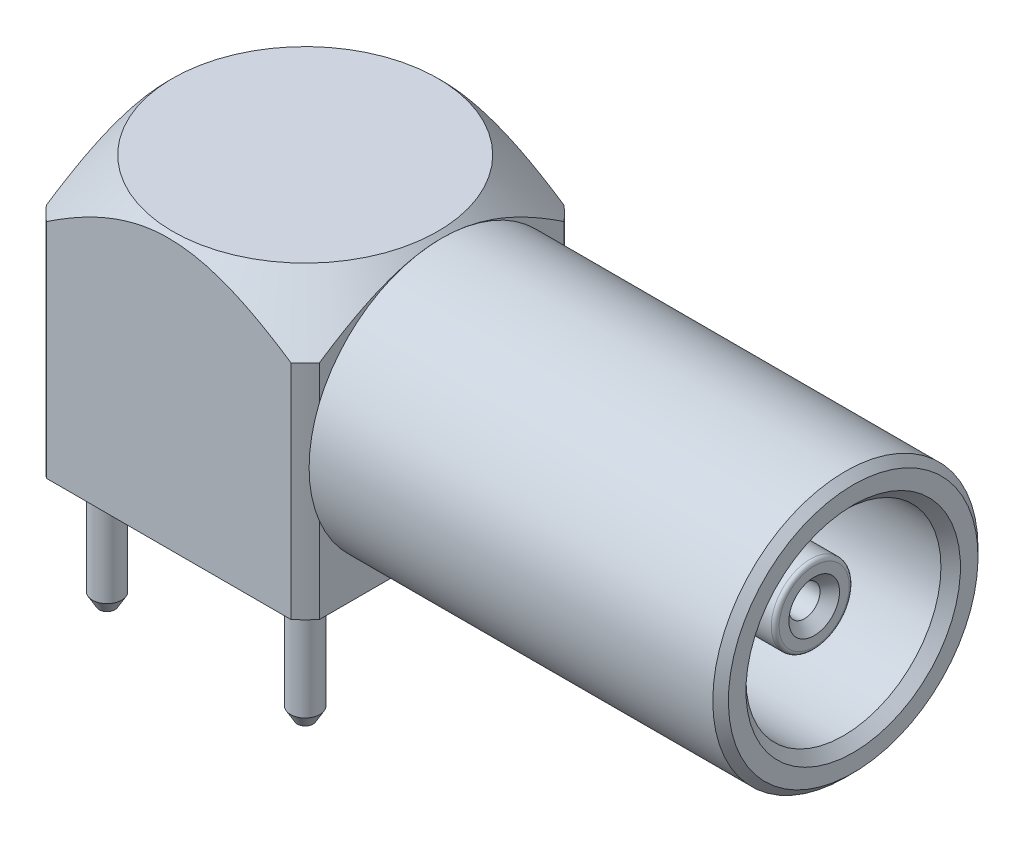
ISO-10303-21;
HEADER;
FILE_DESCRIPTION(('STEP AP214'),'2;1');
FILE_NAME('part.step','',(''),(''),'','','');
FILE_SCHEMA(('AUTOMOTIVE_DESIGN { 1 0 10303 214 1 1 1 1 }'));
ENDSEC;
DATA;
#1=APPLICATION_CONTEXT('core data for automotive mechanical design processes');
#2=APPLICATION_PROTOCOL_DEFINITION('international standard','automotive_design',2000,#1);
#3=PRODUCT_CONTEXT('',#1,'mechanical');
#4=PRODUCT('Part','Part','',(#3));
#5=PRODUCT_RELATED_PRODUCT_CATEGORY('part','',(#4));
#6=PRODUCT_DEFINITION_FORMATION('','',#4);
#7=PRODUCT_DEFINITION_CONTEXT('part definition',#1,'design');
#8=PRODUCT_DEFINITION('design','',#6,#7);
#9=PRODUCT_DEFINITION_SHAPE('','',#8);
#10=(LENGTH_UNIT() NAMED_UNIT(*) SI_UNIT(.MILLI.,.METRE.));
#11=(NAMED_UNIT(*) PLANE_ANGLE_UNIT() SI_UNIT($,.RADIAN.));
#12=(NAMED_UNIT(*) SI_UNIT($,.STERADIAN.) SOLID_ANGLE_UNIT());
#13=UNCERTAINTY_MEASURE_WITH_UNIT(LENGTH_MEASURE(1.E-05),#10,'distance_accuracy_value','');
#14=(GEOMETRIC_REPRESENTATION_CONTEXT(3) GLOBAL_UNCERTAINTY_ASSIGNED_CONTEXT((#13)) GLOBAL_UNIT_ASSIGNED_CONTEXT((#10,
#11,#12)) REPRESENTATION_CONTEXT('',''));
#15=CARTESIAN_POINT('',(0.,0.,0.));
#16=DIRECTION('',(0.,0.,1.));
#17=DIRECTION('',(1.,0.,0.));
#18=AXIS2_PLACEMENT_3D('',#15,#16,#17);
#19=CARTESIAN_POINT('',(-9.,0.,0.));
#20=DIRECTION('',(1.,0.,0.));
#21=DIRECTION('',(0.,1.,0.));
#22=AXIS2_PLACEMENT_3D('',#19,#20,#21);
#23=CYLINDRICAL_SURFACE('',#22,1.);
#24=CARTESIAN_POINT('',(-1.1,0.,0.));
#25=DIRECTION('',(1.,0.,0.));
#26=DIRECTION('',(0.,1.,0.));
#27=AXIS2_PLACEMENT_3D('',#24,#25,#26);
#28=CIRCLE('',#27,1.);
#29=CARTESIAN_POINT('',(-1.1,1.,0.));
#30=VERTEX_POINT('',#29);
#31=EDGE_CURVE('E440',#30,#30,#28,.F.);
#32=ORIENTED_EDGE('',*,*,#31,.T.);
#33=EDGE_LOOP('',(#32));
#34=FACE_BOUND('',#33,.T.);
#35=CARTESIAN_POINT('',(-9.,0.,0.));
#36=DIRECTION('',(1.,0.,0.));
#37=DIRECTION('',(0.,1.,0.));
#38=AXIS2_PLACEMENT_3D('',#35,#36,#37);
#39=CIRCLE('',#38,1.);
#40=CARTESIAN_POINT('',(-9.,0.999999999999999,0.));
#41=VERTEX_POINT('',#40);
#42=EDGE_CURVE('E623',#41,#41,#39,.T.);
#43=ORIENTED_EDGE('',*,*,#42,.T.);
#44=EDGE_LOOP('',(#43));
#45=FACE_BOUND('',#44,.T.);
#46=ADVANCED_FACE('F49',(#34,#45),#23,.T.);
#47=CARTESIAN_POINT('',(-10.55,3.5,-8.75251334901552E-07));
#48=DIRECTION('',(1.,0.,0.));
#49=DIRECTION('',(0.,1.,0.));
#50=AXIS2_PLACEMENT_3D('',#47,#48,#49);
#51=PLANE('',#50);
#52=CARTESIAN_POINT('',(-10.55,2.2,-3.13687830352296));
#53=CARTESIAN_POINT('',(-10.55,3.4,-1.33891197268435));
#54=CARTESIAN_POINT('',(-10.55,3.4,-8.75251335255347E-07));
#55=(BOUNDED_CURVE() B_SPLINE_CURVE(2,(#52,#53,#54),.UNSPECIFIED.,.F.,
.F.) B_SPLINE_CURVE_WITH_KNOTS((3,3),(0.0289629394687463,0.378837270102338),
.UNSPECIFIED.) CURVE() GEOMETRIC_REPRESENTATION_ITEM() RATIONAL_B_SPLINE_CURVE((1.03045700832998,
1.20710678118655,1.20710678118655)) REPRESENTATION_ITEM(''));
#56=CARTESIAN_POINT('',(-10.55,2.2,-3.13687830352296));
#57=VERTEX_POINT('',#56);
#58=CARTESIAN_POINT('',(-10.55,3.4,-8.75251334901552E-07));
#59=VERTEX_POINT('',#58);
#60=EDGE_CURVE('E318',#57,#59,#55,.T.);
#61=ORIENTED_EDGE('',*,*,#60,.T.);
#62=CARTESIAN_POINT('',(-10.55,0.,-8.75251334901552E-07));
#63=DIRECTION('',(-1.,0.,0.));
#64=DIRECTION('',(0.,1.,0.));
#65=AXIS2_PLACEMENT_3D('',#62,#63,#64);
#66=CIRCLE('',#65,3.4);
#67=CARTESIAN_POINT('',(-10.55,1.31148770486039,-3.13687830352296));
#68=VERTEX_POINT('',#67);
#69=EDGE_CURVE('E266',#59,#68,#66,.T.);
#70=ORIENTED_EDGE('',*,*,#69,.T.);
#71=DIRECTION('',(0.,1.,0.));
#72=VECTOR('',#71,1.);
#73=CARTESIAN_POINT('',(-10.55,-3.5,-3.13687830352296));
#74=LINE('',#73,#72);
#75=EDGE_CURVE('E254',#68,#57,#74,.T.);
#76=ORIENTED_EDGE('',*,*,#75,.T.);
#77=EDGE_LOOP('',(#61,#70,#76));
#78=FACE_BOUND('',#77,.T.);
#79=ADVANCED_FACE('F458',(#78),#51,.T.);
#80=CARTESIAN_POINT('',(-14.05,0.,-3.50000087525133));
#81=DIRECTION('',(0.,0.,1.));
#82=DIRECTION('',(1.,0.,0.));
#83=AXIS2_PLACEMENT_3D('',#80,#81,#82);
#84=PLANE('',#83);
#85=CARTESIAN_POINT('',(-17.1868774282716,2.2,-3.50000087525134));
#86=CARTESIAN_POINT('',(-14.0500000000002,4.29361702127646,-3.50000087525133));
#87=CARTESIAN_POINT('',(-10.9131225717291,2.20000000000048,-3.50000087525133));
#88=(BOUNDED_CURVE() B_SPLINE_CURVE(2,(#85,#86,#87),.UNSPECIFIED.,.F.,
.F.) B_SPLINE_CURVE_WITH_KNOTS((3,3),(0.0289629394687464,0.728711600736026),
.UNSPECIFIED.) CURVE() GEOMETRIC_REPRESENTATION_ITEM() RATIONAL_B_SPLINE_CURVE((1.03045700832998,
1.38375655404309,1.03045700833004)) REPRESENTATION_ITEM(''));
#89=CARTESIAN_POINT('',(-17.1868774282716,2.2,-3.50000087525133));
#90=VERTEX_POINT('',#89);
#91=CARTESIAN_POINT('',(-10.9131225717284,2.2,-3.50000087525134));
#92=VERTEX_POINT('',#91);
#93=EDGE_CURVE('E347',#90,#92,#88,.T.);
#94=ORIENTED_EDGE('',*,*,#93,.T.);
#95=DIRECTION('',(0.,-1.,0.));
#96=VECTOR('',#95,1.);
#97=CARTESIAN_POINT('',(-10.9131225717284,-3.5,-3.50000087525133));
#98=LINE('',#97,#96);
#99=CARTESIAN_POINT('',(-10.9131225717284,-3.5,-3.50000087525133));
#100=VERTEX_POINT('',#99);
#101=EDGE_CURVE('E250',#92,#100,#98,.T.);
#102=ORIENTED_EDGE('',*,*,#101,.T.);
#103=DIRECTION('',(1.,0.,0.));
#104=VECTOR('',#103,1.);
#105=CARTESIAN_POINT('',(-10.55,-3.5,-3.50000087525133));
#106=LINE('',#105,#104);
#107=CARTESIAN_POINT('',(-17.1868774282716,-3.5,-3.50000087525133));
#108=VERTEX_POINT('',#107);
#109=EDGE_CURVE('E333',#108,#100,#106,.T.);
#110=ORIENTED_EDGE('',*,*,#109,.F.);
#111=DIRECTION('',(0.,1.,0.));
#112=VECTOR('',#111,1.);
#113=CARTESIAN_POINT('',(-17.1868774282716,-3.5,-3.50000087525133));
#114=LINE('',#113,#112);
#115=EDGE_CURVE('E286',#108,#90,#114,.T.);
#116=ORIENTED_EDGE('',*,*,#115,.T.);
#117=EDGE_LOOP('',(#94,#102,#110,#116));
#118=FACE_BOUND('',#117,.T.);
#119=ADVANCED_FACE('F465',(#118),#84,.F.);
#120=CARTESIAN_POINT('',(-11.51,-6.35,-2.54000087525133));
#121=DIRECTION('',(0.,1.,0.));
#122=DIRECTION('',(-0.48171210335396,0.,0.876329532471834));
#123=AXIS2_PLACEMENT_3D('',#120,#121,#122);
#124=CONICAL_SURFACE('',#123,0.288397459621557,0.523598775598299);
#125=CARTESIAN_POINT('',(-11.51,-6.2,-2.54000087525133));
#126=DIRECTION('',(0.,-1.,0.));
#127=DIRECTION('',(-0.48171210335396,0.,0.876329532471834));
#128=AXIS2_PLACEMENT_3D('',#125,#126,#127);
#129=CIRCLE('',#128,0.375);
#130=CARTESIAN_POINT('',(-11.3293579612423,-6.2,-2.86862444992827));
#131=VERTEX_POINT('',#130);
#132=EDGE_CURVE('E397',#131,#131,#129,.T.);
#133=ORIENTED_EDGE('',*,*,#132,.T.);
#134=EDGE_LOOP('',(#133));
#135=FACE_BOUND('',#134,.T.);
#136=CARTESIAN_POINT('',(-11.51,-6.5,-2.54000087525133));
#137=DIRECTION('',(0.,1.,0.));
#138=DIRECTION('',(-0.48171210335396,0.,0.876329532471834));
#139=AXIS2_PLACEMENT_3D('',#136,#137,#138);
#140=CIRCLE('',#139,0.201794919243113);
#141=CARTESIAN_POINT('',(-11.4127929450053,-6.5,-2.71683972248684));
#142=VERTEX_POINT('',#141);
#143=EDGE_CURVE('E67',#142,#142,#140,.T.);
#144=ORIENTED_EDGE('',*,*,#143,.T.);
#145=EDGE_LOOP('',(#144));
#146=FACE_BOUND('',#145,.T.);
#147=ADVANCED_FACE('F494',(#135,#146),#124,.T.);
#148=CARTESIAN_POINT('',(-11.4196789806211,-6.5,-2.7043126625898));
#149=DIRECTION('',(0.,-1.,0.));
#150=DIRECTION('',(0.,0.,-1.));
#151=AXIS2_PLACEMENT_3D('',#148,#149,#150);
#152=PLANE('',#151);
#153=ORIENTED_EDGE('',*,*,#143,.F.);
#154=EDGE_LOOP('',(#153));
#155=FACE_BOUND('',#154,.T.);
#156=ADVANCED_FACE('F495',(#155),#152,.T.);
#157=CARTESIAN_POINT('',(-11.51,-4.9,-2.54000087525133));
#158=DIRECTION('',(0.,1.,0.));
#159=DIRECTION('',(0.48171210335396,0.,-0.876329532471834));
#160=AXIS2_PLACEMENT_3D('',#157,#158,#159);
#161=CYLINDRICAL_SURFACE('',#160,0.375);
#162=CARTESIAN_POINT('',(-11.51,-3.5,-2.54000087525133));
#163=DIRECTION('',(0.,-1.,0.));
#164=DIRECTION('',(0.48171210335396,0.,-0.876329532471834));
#165=AXIS2_PLACEMENT_3D('',#162,#163,#164);
#166=CIRCLE('',#165,0.375);
#167=CARTESIAN_POINT('',(-11.6906420387577,-3.5,-2.21137730057439));
#168=VERTEX_POINT('',#167);
#169=EDGE_CURVE('E248',#168,#168,#166,.T.);
#170=ORIENTED_EDGE('',*,*,#169,.T.);
#171=EDGE_LOOP('',(#170));
#172=FACE_BOUND('',#171,.T.);
#173=ORIENTED_EDGE('',*,*,#132,.F.);
#174=EDGE_LOOP('',(#173));
#175=FACE_BOUND('',#174,.T.);
#176=ADVANCED_FACE('F525',(#172,#175),#161,.T.);
#177=CARTESIAN_POINT('',(-11.51,-6.35,2.53999912474866));
#178=DIRECTION('',(0.,1.,0.));
#179=DIRECTION('',(-0.48171210335396,0.,0.876329532471834));
#180=AXIS2_PLACEMENT_3D('',#177,#178,#179);
#181=CONICAL_SURFACE('',#180,0.288397459621557,0.523598775598299);
#182=CARTESIAN_POINT('',(-11.51,-6.2,2.53999912474866));
#183=DIRECTION('',(0.,-1.,0.));
#184=DIRECTION('',(-0.48171210335396,0.,0.876329532471834));
#185=AXIS2_PLACEMENT_3D('',#182,#183,#184);
#186=CIRCLE('',#185,0.375);
#187=CARTESIAN_POINT('',(-11.3293579612423,-6.2,2.21137555007173));
#188=VERTEX_POINT('',#187);
#189=EDGE_CURVE('E253',#188,#188,#186,.T.);
#190=ORIENTED_EDGE('',*,*,#189,.T.);
#191=EDGE_LOOP('',(#190));
#192=FACE_BOUND('',#191,.T.);
#193=CARTESIAN_POINT('',(-11.51,-6.5,2.53999912474866));
#194=DIRECTION('',(0.,1.,0.));
#195=DIRECTION('',(-0.48171210335396,0.,0.876329532471834));
#196=AXIS2_PLACEMENT_3D('',#193,#194,#195);
#197=CIRCLE('',#196,0.201794919243113);
#198=CARTESIAN_POINT('',(-11.4127929450053,-6.5,2.36316027751316));
#199=VERTEX_POINT('',#198);
#200=EDGE_CURVE('E353',#199,#199,#197,.T.);
#201=ORIENTED_EDGE('',*,*,#200,.T.);
#202=EDGE_LOOP('',(#201));
#203=FACE_BOUND('',#202,.T.);
#204=ADVANCED_FACE('F521',(#192,#203),#181,.T.);
#205=CARTESIAN_POINT('',(-11.4196789806211,-6.5,2.3756873374102));
#206=DIRECTION('',(0.,-1.,0.));
#207=DIRECTION('',(0.,0.,-1.));
#208=AXIS2_PLACEMENT_3D('',#205,#206,#207);
#209=PLANE('',#208);
#210=ORIENTED_EDGE('',*,*,#200,.F.);
#211=EDGE_LOOP('',(#210));
#212=FACE_BOUND('',#211,.T.);
#213=ADVANCED_FACE('F524',(#212),#209,.T.);
#214=CARTESIAN_POINT('',(-11.51,-4.9,2.53999912474867));
#215=DIRECTION('',(0.,1.,0.));
#216=DIRECTION('',(0.48171210335396,0.,-0.876329532471834));
#217=AXIS2_PLACEMENT_3D('',#214,#215,#216);
#218=CYLINDRICAL_SURFACE('',#217,0.375);
#219=CARTESIAN_POINT('',(-11.51,-3.5,2.53999912474867));
#220=DIRECTION('',(0.,-1.,0.));
#221=DIRECTION('',(0.48171210335396,0.,-0.876329532471834));
#222=AXIS2_PLACEMENT_3D('',#219,#220,#221);
#223=CIRCLE('',#222,0.375);
#224=CARTESIAN_POINT('',(-11.6906420387577,-3.5,2.86862269942561));
#225=VERTEX_POINT('',#224);
#226=EDGE_CURVE('E234',#225,#225,#223,.T.);
#227=ORIENTED_EDGE('',*,*,#226,.T.);
#228=EDGE_LOOP('',(#227));
#229=FACE_BOUND('',#228,.T.);
#230=ORIENTED_EDGE('',*,*,#189,.F.);
#231=EDGE_LOOP('',(#230));
#232=FACE_BOUND('',#231,.T.);
#233=ADVANCED_FACE('F534',(#229,#232),#218,.T.);
#234=CARTESIAN_POINT('',(-10.55,3.5,-8.75251334901552E-07));
#235=DIRECTION('',(1.,0.,0.));
#236=DIRECTION('',(0.,1.,0.));
#237=AXIS2_PLACEMENT_3D('',#234,#235,#236);
#238=PLANE('',#237);
#239=CARTESIAN_POINT('',(-10.55,0.,-8.75251334901552E-07));
#240=DIRECTION('',(-1.,0.,0.));
#241=DIRECTION('',(0.,1.,0.));
#242=AXIS2_PLACEMENT_3D('',#239,#240,#241);
#243=CIRCLE('',#242,3.4);
#244=CARTESIAN_POINT('',(-10.55,1.31148770486039,3.13687655302029));
#245=VERTEX_POINT('',#244);
#246=EDGE_CURVE('E261',#245,#59,#243,.T.);
#247=ORIENTED_EDGE('',*,*,#246,.T.);
#248=CARTESIAN_POINT('',(-10.55,3.4,-8.75251335255347E-07));
#249=CARTESIAN_POINT('',(-10.55,3.4,1.33891022218167));
#250=CARTESIAN_POINT('',(-10.55,2.2,3.13687655302029));
#251=(BOUNDED_CURVE() B_SPLINE_CURVE(2,(#248,#249,#250),.UNSPECIFIED.,.F.,
.F.) B_SPLINE_CURVE_WITH_KNOTS((3,3),(0.378837270102338,0.728711600735929),
.UNSPECIFIED.) CURVE() GEOMETRIC_REPRESENTATION_ITEM() RATIONAL_B_SPLINE_CURVE((1.20710678118655,
1.20710678118655,1.03045700832998)) REPRESENTATION_ITEM(''));
#252=CARTESIAN_POINT('',(-10.55,2.2,3.13687655302029));
#253=VERTEX_POINT('',#252);
#254=EDGE_CURVE('E309',#59,#253,#251,.T.);
#255=ORIENTED_EDGE('',*,*,#254,.T.);
#256=DIRECTION('',(0.,-1.,0.));
#257=VECTOR('',#256,1.);
#258=CARTESIAN_POINT('',(-10.55,-3.5,3.13687655302029));
#259=LINE('',#258,#257);
#260=EDGE_CURVE('E289',#253,#245,#259,.T.);
#261=ORIENTED_EDGE('',*,*,#260,.T.);
#262=EDGE_LOOP('',(#247,#255,#261));
#263=FACE_BOUND('',#262,.T.);
#264=ADVANCED_FACE('F531',(#263),#238,.T.);
#265=CARTESIAN_POINT('',(-14.05,-3.5,-8.75251334901552E-07));
#266=DIRECTION('',(0.,1.,0.));
#267=DIRECTION('',(-0.667420729419494,0.,0.74468085106383));
#268=AXIS2_PLACEMENT_3D('',#265,#266,#267);
#269=CYLINDRICAL_SURFACE('',#268,4.7);
#270=CARTESIAN_POINT('',(-14.05,2.2,-8.75251334901552E-07));
#271=DIRECTION('',(0.,1.,0.));
#272=DIRECTION('',(-0.667420729419494,0.,0.74468085106383));
#273=AXIS2_PLACEMENT_3D('',#270,#271,#272);
#274=CIRCLE('',#273,4.7);
#275=EDGE_CURVE('E343',#57,#92,#274,.T.);
#276=ORIENTED_EDGE('',*,*,#275,.F.);
#277=ORIENTED_EDGE('',*,*,#75,.F.);
#278=DIRECTION('',(0.,1.,0.));
#279=VECTOR('',#278,1.);
#280=CARTESIAN_POINT('',(-10.55,-3.5,-3.13687830352296));
#281=LINE('',#280,#279);
#282=CARTESIAN_POINT('',(-10.55,-1.31148770486039,-3.13687830352296));
#283=VERTEX_POINT('',#282);
#284=EDGE_CURVE('E281',#283,#68,#281,.T.);
#285=ORIENTED_EDGE('',*,*,#284,.F.);
#286=DIRECTION('',(0.,1.,0.));
#287=VECTOR('',#286,1.);
#288=CARTESIAN_POINT('',(-10.55,-3.5,-3.13687830352296));
#289=LINE('',#288,#287);
#290=CARTESIAN_POINT('',(-10.55,-3.5,-3.13687830352296));
#291=VERTEX_POINT('',#290);
#292=EDGE_CURVE('E298',#291,#283,#289,.T.);
#293=ORIENTED_EDGE('',*,*,#292,.F.);
#294=CARTESIAN_POINT('',(-14.05,-3.5,-8.75251334901552E-07));
#295=DIRECTION('',(0.,-1.,0.));
#296=DIRECTION('',(-0.667420729419494,0.,0.74468085106383));
#297=AXIS2_PLACEMENT_3D('',#294,#295,#296);
#298=CIRCLE('',#297,4.7);
#299=EDGE_CURVE('E249',#100,#291,#298,.T.);
#300=ORIENTED_EDGE('',*,*,#299,.F.);
#301=ORIENTED_EDGE('',*,*,#101,.F.);
#302=EDGE_LOOP('',(#276,#277,#285,#293,#300,#301));
#303=FACE_BOUND('',#302,.T.);
#304=ADVANCED_FACE('F513',(#303),#269,.T.);
#305=CARTESIAN_POINT('',(-14.05,-3.5,-8.75251334901552E-07));
#306=DIRECTION('',(0.,1.,0.));
#307=DIRECTION('',(0.74468085106383,0.,0.667420729419495));
#308=AXIS2_PLACEMENT_3D('',#305,#306,#307);
#309=CYLINDRICAL_SURFACE('',#308,4.7);
#310=CARTESIAN_POINT('',(-14.05,2.2,-8.75251334901552E-07));
#311=DIRECTION('',(0.,1.,0.));
#312=DIRECTION('',(0.74468085106383,0.,0.667420729419495));
#313=AXIS2_PLACEMENT_3D('',#310,#311,#312);
#314=CIRCLE('',#313,4.7);
#315=CARTESIAN_POINT('',(-17.55,2.2,-3.13687830352296));
#316=VERTEX_POINT('',#315);
#317=EDGE_CURVE('E342',#90,#316,#314,.T.);
#318=ORIENTED_EDGE('',*,*,#317,.F.);
#319=ORIENTED_EDGE('',*,*,#115,.F.);
#320=CARTESIAN_POINT('',(-14.05,-3.5,-8.75251334901552E-07));
#321=DIRECTION('',(0.,-1.,0.));
#322=DIRECTION('',(0.74468085106383,0.,0.667420729419495));
#323=AXIS2_PLACEMENT_3D('',#320,#321,#322);
#324=CIRCLE('',#323,4.7);
#325=CARTESIAN_POINT('',(-17.55,-3.5,-3.13687830352296));
#326=VERTEX_POINT('',#325);
#327=EDGE_CURVE('E259',#326,#108,#324,.T.);
#328=ORIENTED_EDGE('',*,*,#327,.F.);
#329=DIRECTION('',(0.,-1.,0.));
#330=VECTOR('',#329,1.);
#331=CARTESIAN_POINT('',(-17.55,-3.5,-3.13687830352296));
#332=LINE('',#331,#330);
#333=EDGE_CURVE('E307',#316,#326,#332,.T.);
#334=ORIENTED_EDGE('',*,*,#333,.F.);
#335=EDGE_LOOP('',(#318,#319,#328,#334));
#336=FACE_BOUND('',#335,.T.);
#337=ADVANCED_FACE('F509',(#336),#309,.T.);
#338=CARTESIAN_POINT('',(-14.05,-3.5,-8.75251334901552E-07));
#339=DIRECTION('',(0.,1.,0.));
#340=DIRECTION('',(0.667420729419495,0.,-0.74468085106383));
#341=AXIS2_PLACEMENT_3D('',#338,#339,#340);
#342=CYLINDRICAL_SURFACE('',#341,4.7);
#343=CARTESIAN_POINT('',(-14.05,2.2,-8.75251334901552E-07));
#344=DIRECTION('',(0.,1.,0.));
#345=DIRECTION('',(0.667420729419495,0.,-0.74468085106383));
#346=AXIS2_PLACEMENT_3D('',#343,#344,#345);
#347=CIRCLE('',#346,4.7);
#348=CARTESIAN_POINT('',(-17.55,2.2,3.13687655302029));
#349=VERTEX_POINT('',#348);
#350=CARTESIAN_POINT('',(-17.1868774282716,2.2,3.49999912474867));
#351=VERTEX_POINT('',#350);
#352=EDGE_CURVE('E339',#349,#351,#347,.T.);
#353=ORIENTED_EDGE('',*,*,#352,.F.);
#354=DIRECTION('',(0.,1.,0.));
#355=VECTOR('',#354,1.);
#356=CARTESIAN_POINT('',(-17.55,-3.5,3.13687655302029));
#357=LINE('',#356,#355);
#358=CARTESIAN_POINT('',(-17.55,-3.5,3.13687655302029));
#359=VERTEX_POINT('',#358);
#360=EDGE_CURVE('E348',#359,#349,#357,.T.);
#361=ORIENTED_EDGE('',*,*,#360,.F.);
#362=CARTESIAN_POINT('',(-14.05,-3.5,-8.75251334901552E-07));
#363=DIRECTION('',(0.,-1.,0.));
#364=DIRECTION('',(0.667420729419495,0.,-0.74468085106383));
#365=AXIS2_PLACEMENT_3D('',#362,#363,#364);
#366=CIRCLE('',#365,4.7);
#367=CARTESIAN_POINT('',(-17.1868774282716,-3.5,3.49999912474867));
#368=VERTEX_POINT('',#367);
#369=EDGE_CURVE('E260',#368,#359,#366,.T.);
#370=ORIENTED_EDGE('',*,*,#369,.F.);
#371=DIRECTION('',(0.,-1.,0.));
#372=VECTOR('',#371,1.);
#373=CARTESIAN_POINT('',(-17.1868774282716,-3.5,3.49999912474867));
#374=LINE('',#373,#372);
#375=EDGE_CURVE('E385',#351,#368,#374,.T.);
#376=ORIENTED_EDGE('',*,*,#375,.F.);
#377=EDGE_LOOP('',(#353,#361,#370,#376));
#378=FACE_BOUND('',#377,.T.);
#379=ADVANCED_FACE('F512',(#378),#342,.T.);
#380=CARTESIAN_POINT('',(-14.05,-3.5,-8.75251334901552E-07));
#381=DIRECTION('',(0.,1.,0.));
#382=DIRECTION('',(-0.74468085106383,0.,-0.667420729419495));
#383=AXIS2_PLACEMENT_3D('',#380,#381,#382);
#384=CYLINDRICAL_SURFACE('',#383,4.7);
#385=CARTESIAN_POINT('',(-14.05,2.2,-8.75251334901552E-07));
#386=DIRECTION('',(0.,1.,0.));
#387=DIRECTION('',(-0.74468085106383,0.,-0.667420729419495));
#388=AXIS2_PLACEMENT_3D('',#385,#386,#387);
#389=CIRCLE('',#388,4.7);
#390=CARTESIAN_POINT('',(-10.9131225717284,2.2,3.49999912474867));
#391=VERTEX_POINT('',#390);
#392=EDGE_CURVE('E319',#391,#253,#389,.T.);
#393=ORIENTED_EDGE('',*,*,#392,.F.);
#394=DIRECTION('',(0.,1.,0.));
#395=VECTOR('',#394,1.);
#396=CARTESIAN_POINT('',(-10.9131225717284,-3.5,3.49999912474867));
#397=LINE('',#396,#395);
#398=CARTESIAN_POINT('',(-10.9131225717284,-3.5,3.49999912474867));
#399=VERTEX_POINT('',#398);
#400=EDGE_CURVE('E382',#399,#391,#397,.T.);
#401=ORIENTED_EDGE('',*,*,#400,.F.);
#402=CARTESIAN_POINT('',(-14.05,-3.5,-8.75251334901552E-07));
#403=DIRECTION('',(0.,-1.,0.));
#404=DIRECTION('',(-0.74468085106383,0.,-0.667420729419495));
#405=AXIS2_PLACEMENT_3D('',#402,#403,#404);
#406=CIRCLE('',#405,4.7);
#407=CARTESIAN_POINT('',(-10.55,-3.5,3.13687655302029));
#408=VERTEX_POINT('',#407);
#409=EDGE_CURVE('E240',#408,#399,#406,.T.);
#410=ORIENTED_EDGE('',*,*,#409,.F.);
#411=DIRECTION('',(0.,-1.,0.));
#412=VECTOR('',#411,1.);
#413=CARTESIAN_POINT('',(-10.55,-3.5,3.13687655302029));
#414=LINE('',#413,#412);
#415=CARTESIAN_POINT('',(-10.55,-1.3114877048604,3.13687655302029));
#416=VERTEX_POINT('',#415);
#417=EDGE_CURVE('E265',#416,#408,#414,.T.);
#418=ORIENTED_EDGE('',*,*,#417,.F.);
#419=DIRECTION('',(0.,-1.,0.));
#420=VECTOR('',#419,1.);
#421=CARTESIAN_POINT('',(-10.55,-3.5,3.13687655302029));
#422=LINE('',#421,#420);
#423=EDGE_CURVE('E275',#245,#416,#422,.T.);
#424=ORIENTED_EDGE('',*,*,#423,.F.);
#425=ORIENTED_EDGE('',*,*,#260,.F.);
#426=EDGE_LOOP('',(#393,#401,#410,#418,#424,#425));
#427=FACE_BOUND('',#426,.T.);
#428=ADVANCED_FACE('F519',(#427),#384,.T.);
#429=CARTESIAN_POINT('',(-14.05,2.72512626584708,-8.75251334901552E-07));
#430=DIRECTION('',(0.,-1.,0.));
#431=DIRECTION('',(-0.707106781186548,0.,0.707106781186548));
#432=AXIS2_PLACEMENT_3D('',#429,#430,#431);
#433=CONICAL_SURFACE('',#432,4.17487373415292,0.785398163397448);
#434=CARTESIAN_POINT('',(-14.05,3.5,-8.75251334901552E-07));
#435=DIRECTION('',(0.,1.,0.));
#436=DIRECTION('',(-0.707106781186548,0.,0.707106781186548));
#437=AXIS2_PLACEMENT_3D('',#434,#435,#436);
#438=CIRCLE('',#437,3.4);
#439=CARTESIAN_POINT('',(-11.6458369439657,3.5,-2.40416393128559));
#440=VERTEX_POINT('',#439);
#441=EDGE_CURVE('E308',#440,#440,#438,.T.);
#442=ORIENTED_EDGE('',*,*,#441,.F.);
#443=EDGE_LOOP('',(#442));
#444=FACE_BOUND('',#443,.T.);
#445=ORIENTED_EDGE('',*,*,#275,.T.);
#446=ORIENTED_EDGE('',*,*,#93,.F.);
#447=ORIENTED_EDGE('',*,*,#317,.T.);
#448=CARTESIAN_POINT('',(-17.55,2.2,3.13687655302029));
#449=CARTESIAN_POINT('',(-17.55,4.29361702127646,-8.75251133951185E-07));
#450=CARTESIAN_POINT('',(-17.55,2.20000000000048,-3.13687830352224));
#451=(BOUNDED_CURVE() B_SPLINE_CURVE(2,(#448,#449,#450),.UNSPECIFIED.,.F.,
.F.) B_SPLINE_CURVE_WITH_KNOTS((3,3),(0.0289629394687476,0.72871160073603),
.UNSPECIFIED.) CURVE() GEOMETRIC_REPRESENTATION_ITEM() RATIONAL_B_SPLINE_CURVE((1.03045700832998,
1.38375655404308,1.03045700833004)) REPRESENTATION_ITEM(''));
#452=EDGE_CURVE('E301',#349,#316,#451,.T.);
#453=ORIENTED_EDGE('',*,*,#452,.F.);
#454=ORIENTED_EDGE('',*,*,#352,.T.);
#455=CARTESIAN_POINT('',(-10.9131225717284,2.2,3.49999912474867));
#456=CARTESIAN_POINT('',(-14.05,4.29361702127659,3.49999912474867));
#457=CARTESIAN_POINT('',(-17.1868774282716,2.2,3.49999912474867));
#458=(BOUNDED_CURVE() B_SPLINE_CURVE(2,(#455,#456,#457),.UNSPECIFIED.,.F.,
.F.) B_SPLINE_CURVE_WITH_KNOTS((3,3),(0.0289629394687464,0.728711600735929),
.UNSPECIFIED.) CURVE() GEOMETRIC_REPRESENTATION_ITEM() RATIONAL_B_SPLINE_CURVE((1.03045700832998,
1.38375655404312,1.03045700832998)) REPRESENTATION_ITEM(''));
#459=EDGE_CURVE('E388',#391,#351,#458,.T.);
#460=ORIENTED_EDGE('',*,*,#459,.F.);
#461=ORIENTED_EDGE('',*,*,#392,.T.);
#462=ORIENTED_EDGE('',*,*,#254,.F.);
#463=ORIENTED_EDGE('',*,*,#60,.F.);
#464=EDGE_LOOP('',(#445,#446,#447,#453,#454,#460,#461,#462,#463));
#465=FACE_BOUND('',#464,.T.);
#466=ADVANCED_FACE('F515',(#444,#465),#433,.T.);
#467=CARTESIAN_POINT('',(-17.55,-3.5,-8.75251334901552E-07));
#468=DIRECTION('',(-1.,0.,0.));
#469=DIRECTION('',(0.,0.,1.));
#470=AXIS2_PLACEMENT_3D('',#467,#468,#469);
#471=PLANE('',#470);
#472=ORIENTED_EDGE('',*,*,#452,.T.);
#473=ORIENTED_EDGE('',*,*,#333,.T.);
#474=DIRECTION('',(0.,0.,-1.));
#475=VECTOR('',#474,1.);
#476=CARTESIAN_POINT('',(-17.55,-3.5,-8.75251334901552E-07));
#477=LINE('',#476,#475);
#478=EDGE_CURVE('E255',#359,#326,#477,.T.);
#479=ORIENTED_EDGE('',*,*,#478,.F.);
#480=ORIENTED_EDGE('',*,*,#360,.T.);
#481=EDGE_LOOP('',(#472,#473,#479,#480));
#482=FACE_BOUND('',#481,.T.);
#483=ADVANCED_FACE('F518',(#482),#471,.T.);
#484=CARTESIAN_POINT('',(-17.55,3.5,-8.75251334901552E-07));
#485=DIRECTION('',(0.,1.,0.));
#486=DIRECTION('',(1.,0.,0.));
#487=AXIS2_PLACEMENT_3D('',#484,#485,#486);
#488=PLANE('',#487);
#489=ORIENTED_EDGE('',*,*,#441,.T.);
#490=EDGE_LOOP('',(#489));
#491=FACE_BOUND('',#490,.T.);
#492=ADVANCED_FACE('F539',(#491),#488,.T.);
#493=CARTESIAN_POINT('',(-14.05,0.,3.49999912474867));
#494=DIRECTION('',(0.,0.,1.));
#495=DIRECTION('',(1.,0.,0.));
#496=AXIS2_PLACEMENT_3D('',#493,#494,#495);
#497=PLANE('',#496);
#498=ORIENTED_EDGE('',*,*,#459,.T.);
#499=ORIENTED_EDGE('',*,*,#375,.T.);
#500=DIRECTION('',(-1.,0.,0.));
#501=VECTOR('',#500,1.);
#502=CARTESIAN_POINT('',(-10.55,-3.5,3.49999912474867));
#503=LINE('',#502,#501);
#504=EDGE_CURVE('E243',#399,#368,#503,.T.);
#505=ORIENTED_EDGE('',*,*,#504,.F.);
#506=ORIENTED_EDGE('',*,*,#400,.T.);
#507=EDGE_LOOP('',(#498,#499,#505,#506));
#508=FACE_BOUND('',#507,.T.);
#509=ADVANCED_FACE('F542',(#508),#497,.T.);
#510=CARTESIAN_POINT('',(-16.59,-6.35,2.53999912474866));
#511=DIRECTION('',(0.,1.,0.));
#512=DIRECTION('',(-0.48171210335396,0.,0.876329532471834));
#513=AXIS2_PLACEMENT_3D('',#510,#511,#512);
#514=CONICAL_SURFACE('',#513,0.288397459621557,0.523598775598299);
#515=CARTESIAN_POINT('',(-16.59,-6.2,2.53999912474866));
#516=DIRECTION('',(0.,-1.,0.));
#517=DIRECTION('',(-0.48171210335396,0.,0.876329532471834));
#518=AXIS2_PLACEMENT_3D('',#515,#516,#517);
#519=CIRCLE('',#518,0.375);
#520=CARTESIAN_POINT('',(-16.4093579612423,-6.2,2.21137555007172));
#521=VERTEX_POINT('',#520);
#522=EDGE_CURVE('E279',#521,#521,#519,.T.);
#523=ORIENTED_EDGE('',*,*,#522,.T.);
#524=EDGE_LOOP('',(#523));
#525=FACE_BOUND('',#524,.T.);
#526=CARTESIAN_POINT('',(-16.59,-6.5,2.53999912474866));
#527=DIRECTION('',(0.,1.,0.));
#528=DIRECTION('',(-0.48171210335396,0.,0.876329532471834));
#529=AXIS2_PLACEMENT_3D('',#526,#527,#528);
#530=CIRCLE('',#529,0.201794919243113);
#531=CARTESIAN_POINT('',(-16.4927929450053,-6.5,2.36316027751315));
#532=VERTEX_POINT('',#531);
#533=EDGE_CURVE('E379',#532,#532,#530,.T.);
#534=ORIENTED_EDGE('',*,*,#533,.T.);
#535=EDGE_LOOP('',(#534));
#536=FACE_BOUND('',#535,.T.);
#537=ADVANCED_FACE('F486',(#525,#536),#514,.T.);
#538=CARTESIAN_POINT('',(-16.4996789806211,-6.5,2.37568733741019));
#539=DIRECTION('',(0.,-1.,0.));
#540=DIRECTION('',(0.,0.,-1.));
#541=AXIS2_PLACEMENT_3D('',#538,#539,#540);
#542=PLANE('',#541);
#543=ORIENTED_EDGE('',*,*,#533,.F.);
#544=EDGE_LOOP('',(#543));
#545=FACE_BOUND('',#544,.T.);
#546=ADVANCED_FACE('F482',(#545),#542,.T.);
#547=CARTESIAN_POINT('',(-16.59,-4.9,2.53999912474866));
#548=DIRECTION('',(0.,1.,0.));
#549=DIRECTION('',(0.48171210335396,0.,-0.876329532471834));
#550=AXIS2_PLACEMENT_3D('',#547,#548,#549);
#551=CYLINDRICAL_SURFACE('',#550,0.375);
#552=CARTESIAN_POINT('',(-16.59,-3.5,2.53999912474867));
#553=DIRECTION('',(0.,-1.,0.));
#554=DIRECTION('',(0.48171210335396,0.,-0.876329532471834));
#555=AXIS2_PLACEMENT_3D('',#552,#553,#554);
#556=CIRCLE('',#555,0.375);
#557=CARTESIAN_POINT('',(-16.7706420387577,-3.5,2.8686226994256));
#558=VERTEX_POINT('',#557);
#559=EDGE_CURVE('E226',#558,#558,#556,.T.);
#560=ORIENTED_EDGE('',*,*,#559,.T.);
#561=EDGE_LOOP('',(#560));
#562=FACE_BOUND('',#561,.T.);
#563=ORIENTED_EDGE('',*,*,#522,.F.);
#564=EDGE_LOOP('',(#563));
#565=FACE_BOUND('',#564,.T.);
#566=ADVANCED_FACE('F485',(#562,#565),#551,.T.);
#567=CARTESIAN_POINT('',(-14.05,-2.23982312222434,-8.75251334901552E-07));
#568=DIRECTION('',(0.,1.,0.));
#569=DIRECTION('',(-1.,0.,0.));
#570=AXIS2_PLACEMENT_3D('',#567,#568,#569);
#571=CYLINDRICAL_SURFACE('',#570,0.35);
#572=CARTESIAN_POINT('',(-14.05,-3.5,-8.75251334901552E-07));
#573=DIRECTION('',(0.,-1.,0.));
#574=DIRECTION('',(-1.,0.,0.));
#575=AXIS2_PLACEMENT_3D('',#572,#573,#574);
#576=CIRCLE('',#575,0.35);
#577=CARTESIAN_POINT('',(-13.7,-3.5,-8.75251334858689E-07));
#578=VERTEX_POINT('',#577);
#579=EDGE_CURVE('E220',#578,#578,#576,.T.);
#580=ORIENTED_EDGE('',*,*,#579,.T.);
#581=EDGE_LOOP('',(#580));
#582=FACE_BOUND('',#581,.T.);
#583=CARTESIAN_POINT('',(-14.05,-6.01482312222434,-8.75251334901552E-07));
#584=DIRECTION('',(0.,1.,0.));
#585=DIRECTION('',(-1.,0.,0.));
#586=AXIS2_PLACEMENT_3D('',#583,#584,#585);
#587=CIRCLE('',#586,0.35);
#588=CARTESIAN_POINT('',(-13.7,-6.01482312222434,-8.75251334944415E-07));
#589=VERTEX_POINT('',#588);
#590=EDGE_CURVE('E276',#589,#589,#587,.T.);
#591=ORIENTED_EDGE('',*,*,#590,.T.);
#592=EDGE_LOOP('',(#591));
#593=FACE_BOUND('',#592,.T.);
#594=ADVANCED_FACE('F221',(#582,#593),#571,.T.);
#595=CARTESIAN_POINT('',(-14.1383974596216,-6.31482312222434,-8.75251334901552E-07));
#596=DIRECTION('',(0.,-1.,0.));
#597=DIRECTION('',(0.,0.,-1.));
#598=AXIS2_PLACEMENT_3D('',#595,#596,#597);
#599=PLANE('',#598);
#600=CARTESIAN_POINT('',(-14.05,-6.31482312222434,-8.75251334901552E-07));
#601=DIRECTION('',(0.,1.,0.));
#602=DIRECTION('',(-1.,0.,0.));
#603=AXIS2_PLACEMENT_3D('',#600,#601,#602);
#604=CIRCLE('',#603,0.176794919243111);
#605=CARTESIAN_POINT('',(-14.2267949192431,-6.31482312222434,-8.75251334901552E-07));
#606=VERTEX_POINT('',#605);
#607=EDGE_CURVE('E280',#606,#606,#604,.T.);
#608=ORIENTED_EDGE('',*,*,#607,.F.);
#609=EDGE_LOOP('',(#608));
#610=FACE_BOUND('',#609,.T.);
#611=ADVANCED_FACE('F500',(#610),#599,.T.);
#612=CARTESIAN_POINT('',(-14.05,-6.16482312222434,-8.75251334901552E-07));
#613=DIRECTION('',(0.,1.,0.));
#614=DIRECTION('',(-1.,0.,0.));
#615=AXIS2_PLACEMENT_3D('',#612,#613,#614);
#616=CONICAL_SURFACE('',#615,0.263397459621554,0.523598775598299);
#617=ORIENTED_EDGE('',*,*,#590,.F.);
#618=EDGE_LOOP('',(#617));
#619=FACE_BOUND('',#618,.T.);
#620=ORIENTED_EDGE('',*,*,#607,.T.);
#621=EDGE_LOOP('',(#620));
#622=FACE_BOUND('',#621,.T.);
#623=ADVANCED_FACE('F504',(#619,#622),#616,.T.);
#624=CARTESIAN_POINT('',(-10.55,3.5,-8.75251334901552E-07));
#625=DIRECTION('',(1.,0.,0.));
#626=DIRECTION('',(0.,1.,0.));
#627=AXIS2_PLACEMENT_3D('',#624,#625,#626);
#628=PLANE('',#627);
#629=CARTESIAN_POINT('',(-10.55,0.,-8.75251334901552E-07));
#630=DIRECTION('',(-1.,0.,0.));
#631=DIRECTION('',(0.,1.,0.));
#632=AXIS2_PLACEMENT_3D('',#629,#630,#631);
#633=CIRCLE('',#632,3.4);
#634=EDGE_CURVE('E297',#283,#416,#633,.T.);
#635=ORIENTED_EDGE('',*,*,#634,.T.);
#636=ORIENTED_EDGE('',*,*,#417,.T.);
#637=DIRECTION('',(0.,0.,1.));
#638=VECTOR('',#637,1.);
#639=CARTESIAN_POINT('',(-10.55,-3.5,-8.75251334901552E-07));
#640=LINE('',#639,#638);
#641=EDGE_CURVE('E244',#291,#408,#640,.T.);
#642=ORIENTED_EDGE('',*,*,#641,.F.);
#643=ORIENTED_EDGE('',*,*,#292,.T.);
#644=EDGE_LOOP('',(#635,#636,#642,#643));
#645=FACE_BOUND('',#644,.T.);
#646=ADVANCED_FACE('F507',(#645),#628,.T.);
#647=CARTESIAN_POINT('',(-5.275,0.,-8.75251334901552E-07));
#648=DIRECTION('',(1.,0.,0.));
#649=DIRECTION('',(0.,1.,0.));
#650=AXIS2_PLACEMENT_3D('',#647,#648,#649);
#651=CYLINDRICAL_SURFACE('',#650,3.4);
#652=CARTESIAN_POINT('',(-0.2,0.,-8.75251334901552E-07));
#653=DIRECTION('',(1.,0.,0.));
#654=DIRECTION('',(0.,-1.,0.));
#655=AXIS2_PLACEMENT_3D('',#652,#653,#654);
#656=CIRCLE('',#655,3.4);
#657=CARTESIAN_POINT('',(-0.2,-3.4,-8.75251335317932E-07));
#658=VERTEX_POINT('',#657);
#659=EDGE_CURVE('E294',#658,#658,#656,.T.);
#660=ORIENTED_EDGE('',*,*,#659,.F.);
#661=EDGE_LOOP('',(#660));
#662=FACE_BOUND('',#661,.T.);
#663=ORIENTED_EDGE('',*,*,#634,.F.);
#664=CARTESIAN_POINT('',(-10.55,0.,-8.75251334901552E-07));
#665=DIRECTION('',(1.,0.,0.));
#666=DIRECTION('',(0.,1.,0.));
#667=AXIS2_PLACEMENT_3D('',#664,#665,#666);
#668=CIRCLE('',#667,3.4);
#669=EDGE_CURVE('E285',#283,#68,#668,.T.);
#670=ORIENTED_EDGE('',*,*,#669,.T.);
#671=ORIENTED_EDGE('',*,*,#69,.F.);
#672=ORIENTED_EDGE('',*,*,#246,.F.);
#673=CARTESIAN_POINT('',(-10.55,0.,-8.75251334901552E-07));
#674=DIRECTION('',(1.,0.,0.));
#675=DIRECTION('',(0.,1.,0.));
#676=AXIS2_PLACEMENT_3D('',#673,#674,#675);
#677=CIRCLE('',#676,3.4);
#678=EDGE_CURVE('E270',#245,#416,#677,.T.);
#679=ORIENTED_EDGE('',*,*,#678,.T.);
#680=EDGE_LOOP('',(#663,#670,#671,#672,#679));
#681=FACE_BOUND('',#680,.T.);
#682=ADVANCED_FACE('F558',(#662,#681),#651,.T.);
#683=CARTESIAN_POINT('',(-0.1,0.,-8.75251334901552E-07));
#684=DIRECTION('',(-1.,0.,0.));
#685=DIRECTION('',(0.,-1.,0.));
#686=AXIS2_PLACEMENT_3D('',#683,#684,#685);
#687=CONICAL_SURFACE('',#686,3.3,0.785398163397446);
#688=CARTESIAN_POINT('',(0.,0.,-8.75251334901552E-07));
#689=DIRECTION('',(-1.,0.,0.));
#690=DIRECTION('',(0.,-1.,0.));
#691=AXIS2_PLACEMENT_3D('',#688,#689,#690);
#692=CIRCLE('',#691,3.2);
#693=CARTESIAN_POINT('',(0.,3.2,-8.75251335293439E-07));
#694=VERTEX_POINT('',#693);
#695=EDGE_CURVE('E274',#694,#694,#692,.T.);
#696=ORIENTED_EDGE('',*,*,#695,.T.);
#697=EDGE_LOOP('',(#696));
#698=FACE_BOUND('',#697,.T.);
#699=ORIENTED_EDGE('',*,*,#659,.T.);
#700=EDGE_LOOP('',(#699));
#701=FACE_BOUND('',#700,.T.);
#702=ADVANCED_FACE('F550',(#698,#701),#687,.T.);
#703=CARTESIAN_POINT('',(0.,1.7,-8.75251334901552E-07));
#704=DIRECTION('',(1.,0.,0.));
#705=DIRECTION('',(0.,1.,0.));
#706=AXIS2_PLACEMENT_3D('',#703,#704,#705);
#707=PLANE('',#706);
#708=CARTESIAN_POINT('',(0.,0.,0.));
#709=DIRECTION('',(1.,0.,0.));
#710=DIRECTION('',(0.,1.,0.));
#711=AXIS2_PLACEMENT_3D('',#708,#709,#710);
#712=CIRCLE('',#711,2.75000000000001);
#713=CARTESIAN_POINT('',(0.,2.75000000000001,0.));
#714=VERTEX_POINT('',#713);
#715=EDGE_CURVE('E434',#714,#714,#712,.F.);
#716=ORIENTED_EDGE('',*,*,#715,.T.);
#717=EDGE_LOOP('',(#716));
#718=FACE_BOUND('',#717,.T.);
#719=ORIENTED_EDGE('',*,*,#695,.F.);
#720=EDGE_LOOP('',(#719));
#721=FACE_BOUND('',#720,.T.);
#722=ADVANCED_FACE('F547',(#718,#721),#707,.T.);
#723=CARTESIAN_POINT('',(-10.55,3.2,-8.75251334901552E-07));
#724=DIRECTION('',(-1.,0.,0.));
#725=DIRECTION('',(0.,1.,0.));
#726=AXIS2_PLACEMENT_3D('',#723,#724,#725);
#727=PLANE('',#726);
#728=ORIENTED_EDGE('',*,*,#423,.T.);
#729=ORIENTED_EDGE('',*,*,#678,.F.);
#730=EDGE_LOOP('',(#728,#729));
#731=FACE_BOUND('',#730,.T.);
#732=ADVANCED_FACE('F529',(#731),#727,.T.);
#733=CARTESIAN_POINT('',(-10.55,3.2,-8.75251334901552E-07));
#734=DIRECTION('',(-1.,0.,0.));
#735=DIRECTION('',(0.,1.,0.));
#736=AXIS2_PLACEMENT_3D('',#733,#734,#735);
#737=PLANE('',#736);
#738=ORIENTED_EDGE('',*,*,#284,.T.);
#739=ORIENTED_EDGE('',*,*,#669,.F.);
#740=EDGE_LOOP('',(#738,#739));
#741=FACE_BOUND('',#740,.T.);
#742=ADVANCED_FACE('F492',(#741),#737,.T.);
#743=CARTESIAN_POINT('',(-16.59,-4.9,-2.54000087525133));
#744=DIRECTION('',(0.,1.,0.));
#745=DIRECTION('',(0.48171210335396,0.,-0.876329532471834));
#746=AXIS2_PLACEMENT_3D('',#743,#744,#745);
#747=CYLINDRICAL_SURFACE('',#746,0.375);
#748=CARTESIAN_POINT('',(-16.59,-3.5,-2.54000087525133));
#749=DIRECTION('',(0.,-1.,0.));
#750=DIRECTION('',(0.48171210335396,0.,-0.876329532471834));
#751=AXIS2_PLACEMENT_3D('',#748,#749,#750);
#752=CIRCLE('',#751,0.375);
#753=CARTESIAN_POINT('',(-16.7706420387577,-3.5,-2.21137730057439));
#754=VERTEX_POINT('',#753);
#755=EDGE_CURVE('E268',#754,#754,#752,.T.);
#756=ORIENTED_EDGE('',*,*,#755,.T.);
#757=EDGE_LOOP('',(#756));
#758=FACE_BOUND('',#757,.T.);
#759=CARTESIAN_POINT('',(-16.59,-6.2,-2.54000087525134));
#760=DIRECTION('',(0.,-1.,0.));
#761=DIRECTION('',(-0.48171210335396,0.,0.876329532471834));
#762=AXIS2_PLACEMENT_3D('',#759,#760,#761);
#763=CIRCLE('',#762,0.375);
#764=CARTESIAN_POINT('',(-16.7706420387577,-6.2,-2.2113773005744));
#765=VERTEX_POINT('',#764);
#766=EDGE_CURVE('E231',#765,#765,#763,.T.);
#767=ORIENTED_EDGE('',*,*,#766,.F.);
#768=EDGE_LOOP('',(#767));
#769=FACE_BOUND('',#768,.T.);
#770=ADVANCED_FACE('F488',(#758,#769),#747,.T.);
#771=CARTESIAN_POINT('',(-16.4996789806211,-6.5,-2.70431266258981));
#772=DIRECTION('',(0.,-1.,0.));
#773=DIRECTION('',(0.,0.,-1.));
#774=AXIS2_PLACEMENT_3D('',#771,#772,#773);
#775=PLANE('',#774);
#776=CARTESIAN_POINT('',(-16.59,-6.5,-2.54000087525134));
#777=DIRECTION('',(0.,1.,0.));
#778=DIRECTION('',(-0.48171210335396,0.,0.876329532471834));
#779=AXIS2_PLACEMENT_3D('',#776,#777,#778);
#780=CIRCLE('',#779,0.201794919243113);
#781=CARTESIAN_POINT('',(-16.4927929450053,-6.5,-2.71683972248685));
#782=VERTEX_POINT('',#781);
#783=EDGE_CURVE('E225',#782,#782,#780,.T.);
#784=ORIENTED_EDGE('',*,*,#783,.F.);
#785=EDGE_LOOP('',(#784));
#786=FACE_BOUND('',#785,.T.);
#787=ADVANCED_FACE('F491',(#786),#775,.T.);
#788=CARTESIAN_POINT('',(-16.59,-6.35,-2.54000087525134));
#789=DIRECTION('',(0.,1.,0.));
#790=DIRECTION('',(-0.48171210335396,0.,0.876329532471834));
#791=AXIS2_PLACEMENT_3D('',#788,#789,#790);
#792=CONICAL_SURFACE('',#791,0.288397459621557,0.523598775598299);
#793=ORIENTED_EDGE('',*,*,#766,.T.);
#794=EDGE_LOOP('',(#793));
#795=FACE_BOUND('',#794,.T.);
#796=ORIENTED_EDGE('',*,*,#783,.T.);
#797=EDGE_LOOP('',(#796));
#798=FACE_BOUND('',#797,.T.);
#799=ADVANCED_FACE('F503',(#795,#798),#792,.T.);
#800=CARTESIAN_POINT('',(-10.55,-3.5,-8.75251334901552E-07));
#801=DIRECTION('',(0.,-1.,0.));
#802=DIRECTION('',(-1.,0.,0.));
#803=AXIS2_PLACEMENT_3D('',#800,#801,#802);
#804=PLANE('',#803);
#805=ORIENTED_EDGE('',*,*,#579,.F.);
#806=EDGE_LOOP('',(#805));
#807=FACE_BOUND('',#806,.T.);
#808=ORIENTED_EDGE('',*,*,#559,.F.);
#809=EDGE_LOOP('',(#808));
#810=FACE_BOUND('',#809,.T.);
#811=ORIENTED_EDGE('',*,*,#226,.F.);
#812=EDGE_LOOP('',(#811));
#813=FACE_BOUND('',#812,.T.);
#814=ORIENTED_EDGE('',*,*,#755,.F.);
#815=EDGE_LOOP('',(#814));
#816=FACE_BOUND('',#815,.T.);
#817=ORIENTED_EDGE('',*,*,#169,.F.);
#818=EDGE_LOOP('',(#817));
#819=FACE_BOUND('',#818,.T.);
#820=ORIENTED_EDGE('',*,*,#409,.T.);
#821=ORIENTED_EDGE('',*,*,#504,.T.);
#822=ORIENTED_EDGE('',*,*,#369,.T.);
#823=ORIENTED_EDGE('',*,*,#478,.T.);
#824=ORIENTED_EDGE('',*,*,#327,.T.);
#825=ORIENTED_EDGE('',*,*,#109,.T.);
#826=ORIENTED_EDGE('',*,*,#299,.T.);
#827=ORIENTED_EDGE('',*,*,#641,.T.);
#828=EDGE_LOOP('',(#820,#821,#822,#823,#824,#825,#826,#827));
#829=FACE_BOUND('',#828,.T.);
#830=ADVANCED_FACE('F480',(#807,#810,#813,#816,#819,#829),#804,.T.);
#831=CARTESIAN_POINT('',(-9.,0.,0.));
#832=DIRECTION('',(1.,0.,0.));
#833=DIRECTION('',(0.,1.,0.));
#834=AXIS2_PLACEMENT_3D('',#831,#832,#833);
#835=CYLINDRICAL_SURFACE('',#834,2.5);
#836=CARTESIAN_POINT('',(-0.250000000000004,0.,0.));
#837=DIRECTION('',(1.,0.,0.));
#838=DIRECTION('',(0.,1.,0.));
#839=AXIS2_PLACEMENT_3D('',#836,#837,#838);
#840=CIRCLE('',#839,2.5);
#841=CARTESIAN_POINT('',(-0.250000000000004,2.5,0.));
#842=VERTEX_POINT('',#841);
#843=EDGE_CURVE('E414',#842,#842,#840,.T.);
#844=ORIENTED_EDGE('',*,*,#843,.T.);
#845=EDGE_LOOP('',(#844));
#846=FACE_BOUND('',#845,.T.);
#847=CARTESIAN_POINT('',(-9.,0.,0.));
#848=DIRECTION('',(1.,0.,0.));
#849=DIRECTION('',(0.,1.,0.));
#850=AXIS2_PLACEMENT_3D('',#847,#848,#849);
#851=CIRCLE('',#850,2.5);
#852=CARTESIAN_POINT('',(-9.,2.5,0.));
#853=VERTEX_POINT('',#852);
#854=EDGE_CURVE('E238',#853,#853,#851,.T.);
#855=ORIENTED_EDGE('',*,*,#854,.F.);
#856=EDGE_LOOP('',(#855));
#857=FACE_BOUND('',#856,.T.);
#858=ADVANCED_FACE('F476',(#846,#857),#835,.F.);
#859=CARTESIAN_POINT('',(-9.,0.,0.));
#860=DIRECTION('',(1.,0.,0.));
#861=DIRECTION('',(0.,1.,0.));
#862=AXIS2_PLACEMENT_3D('',#859,#860,#861);
#863=PLANE('',#862);
#864=ORIENTED_EDGE('',*,*,#42,.F.);
#865=EDGE_LOOP('',(#864));
#866=FACE_BOUND('',#865,.T.);
#867=ORIENTED_EDGE('',*,*,#854,.T.);
#868=EDGE_LOOP('',(#867));
#869=FACE_BOUND('',#868,.T.);
#870=ADVANCED_FACE('F473',(#866,#869),#863,.T.);
#871=CARTESIAN_POINT('',(-1.,0.,0.));
#872=DIRECTION('',(1.,0.,0.));
#873=DIRECTION('',(0.,1.,0.));
#874=AXIS2_PLACEMENT_3D('',#871,#872,#873);
#875=PLANE('',#874);
#876=CARTESIAN_POINT('',(-1.,0.,0.));
#877=DIRECTION('',(1.,0.,0.));
#878=DIRECTION('',(0.,1.,0.));
#879=AXIS2_PLACEMENT_3D('',#876,#877,#878);
#880=CIRCLE('',#879,0.649999999999999);
#881=CARTESIAN_POINT('',(-1.,0.649999999999999,0.));
#882=VERTEX_POINT('',#881);
#883=EDGE_CURVE('E11',#882,#882,#880,.F.);
#884=ORIENTED_EDGE('',*,*,#883,.T.);
#885=EDGE_LOOP('',(#884));
#886=FACE_BOUND('',#885,.T.);
#887=CARTESIAN_POINT('',(-1.,0.,0.));
#888=DIRECTION('',(1.,0.,0.));
#889=DIRECTION('',(0.,1.,0.));
#890=AXIS2_PLACEMENT_3D('',#887,#888,#889);
#891=CIRCLE('',#890,0.9);
#892=CARTESIAN_POINT('',(-1.,0.9,0.));
#893=VERTEX_POINT('',#892);
#894=EDGE_CURVE('E437',#893,#893,#891,.T.);
#895=ORIENTED_EDGE('',*,*,#894,.T.);
#896=EDGE_LOOP('',(#895));
#897=FACE_BOUND('',#896,.T.);
#898=ADVANCED_FACE('F471',(#886,#897),#875,.T.);
#899=CARTESIAN_POINT('',(-9.,0.,0.));
#900=DIRECTION('',(1.,0.,0.));
#901=DIRECTION('',(0.,1.,0.));
#902=AXIS2_PLACEMENT_3D('',#899,#900,#901);
#903=CYLINDRICAL_SURFACE('',#902,0.4);
#904=CARTESIAN_POINT('',(-1.25,0.,0.));
#905=DIRECTION('',(1.,0.,0.));
#906=DIRECTION('',(0.,1.,0.));
#907=AXIS2_PLACEMENT_3D('',#904,#905,#906);
#908=CIRCLE('',#907,0.4);
#909=CARTESIAN_POINT('',(-1.25,0.4,0.));
#910=VERTEX_POINT('',#909);
#911=EDGE_CURVE('E59',#910,#910,#908,.T.);
#912=ORIENTED_EDGE('',*,*,#911,.T.);
#913=EDGE_LOOP('',(#912));
#914=FACE_BOUND('',#913,.T.);
#915=CARTESIAN_POINT('',(-9.,0.,0.));
#916=DIRECTION('',(1.,0.,0.));
#917=DIRECTION('',(0.,1.,0.));
#918=AXIS2_PLACEMENT_3D('',#915,#916,#917);
#919=CIRCLE('',#918,0.4);
#920=CARTESIAN_POINT('',(-9.,0.399999999999999,0.));
#921=VERTEX_POINT('',#920);
#922=EDGE_CURVE('E625',#921,#921,#919,.T.);
#923=ORIENTED_EDGE('',*,*,#922,.F.);
#924=EDGE_LOOP('',(#923));
#925=FACE_BOUND('',#924,.T.);
#926=ADVANCED_FACE('F445',(#914,#925),#903,.F.);
#927=CARTESIAN_POINT('',(-9.,0.,0.));
#928=DIRECTION('',(1.,0.,0.));
#929=DIRECTION('',(0.,1.,0.));
#930=AXIS2_PLACEMENT_3D('',#927,#928,#929);
#931=PLANE('',#930);
#932=ORIENTED_EDGE('',*,*,#922,.T.);
#933=EDGE_LOOP('',(#932));
#934=FACE_BOUND('',#933,.T.);
#935=ADVANCED_FACE('F608',(#934),#931,.T.);
#936=CARTESIAN_POINT('',(-0.250000000000004,0.,0.));
#937=DIRECTION('',(1.,0.,0.));
#938=DIRECTION('',(0.,1.,0.));
#939=AXIS2_PLACEMENT_3D('',#936,#937,#938);
#940=CONICAL_SURFACE('',#939,2.5,0.785398163397456);
#941=ORIENTED_EDGE('',*,*,#715,.F.);
#942=EDGE_LOOP('',(#941));
#943=FACE_BOUND('',#942,.T.);
#944=ORIENTED_EDGE('',*,*,#843,.F.);
#945=EDGE_LOOP('',(#944));
#946=FACE_BOUND('',#945,.T.);
#947=ADVANCED_FACE('F454',(#943,#946),#940,.F.);
#948=CARTESIAN_POINT('',(-1.1,0.,0.));
#949=DIRECTION('',(1.,0.,0.));
#950=DIRECTION('',(0.,1.,0.));
#951=AXIS2_PLACEMENT_3D('',#948,#949,#950);
#952=TOROIDAL_SURFACE('',#951,0.9,0.1);
#953=ORIENTED_EDGE('',*,*,#31,.F.);
#954=EDGE_LOOP('',(#953));
#955=FACE_BOUND('',#954,.T.);
#956=ORIENTED_EDGE('',*,*,#894,.F.);
#957=EDGE_LOOP('',(#956));
#958=FACE_BOUND('',#957,.T.);
#959=ADVANCED_FACE('F449',(#955,#958),#952,.T.);
#960=CARTESIAN_POINT('',(-1.25,0.,0.));
#961=DIRECTION('',(1.,0.,0.));
#962=DIRECTION('',(0.,1.,0.));
#963=AXIS2_PLACEMENT_3D('',#960,#961,#962);
#964=CONICAL_SURFACE('',#963,0.4,0.78539816339745);
#965=ORIENTED_EDGE('',*,*,#883,.F.);
#966=EDGE_LOOP('',(#965));
#967=FACE_BOUND('',#966,.T.);
#968=ORIENTED_EDGE('',*,*,#911,.F.);
#969=EDGE_LOOP('',(#968));
#970=FACE_BOUND('',#969,.T.);
#971=ADVANCED_FACE('F52',(#967,#970),#964,.F.);
#972=CLOSED_SHELL('',(#46,#79,#119,#147,#156,#176,#204,#213,#233,#264,#304,#337,#379,#428,#466,
#483,#492,#509,#537,#546,#566,#594,#611,#623,#646,#682,#702,#722,#732,#742,#770,#787,#799,#830,
#858,#870,#898,#926,#935,#947,#959,#971));
#973=MANIFOLD_SOLID_BREP('B2',#972);
#974=ADVANCED_BREP_SHAPE_REPRESENTATION('',(#18,#973),#14);
#975=SHAPE_DEFINITION_REPRESENTATION(#9,#974);
ENDSEC;
END-ISO-10303-21;
